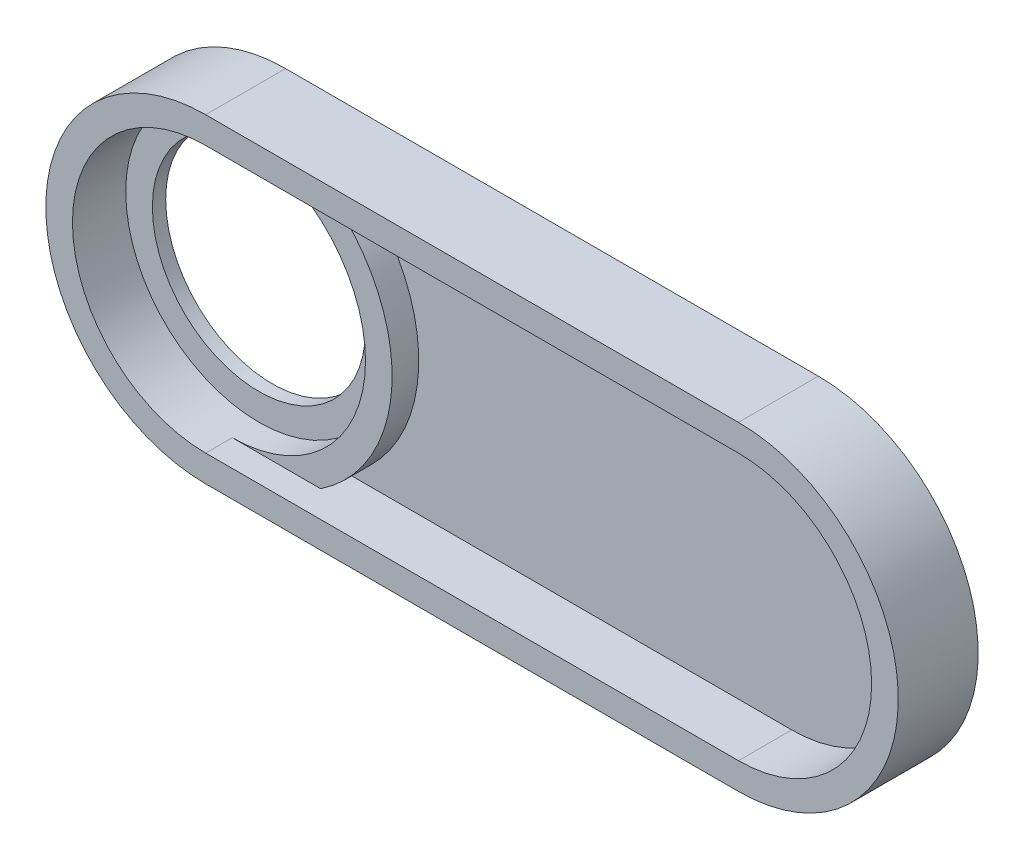
ISO-10303-21;
HEADER;
FILE_DESCRIPTION(('STEP AP214'),'2;1');
FILE_NAME('part.step','',(''),(''),'','','');
FILE_SCHEMA(('AUTOMOTIVE_DESIGN { 1 0 10303 214 1 1 1 1 }'));
ENDSEC;
DATA;
#1=APPLICATION_CONTEXT('core data for automotive mechanical design processes');
#2=APPLICATION_PROTOCOL_DEFINITION('international standard','automotive_design',2000,#1);
#3=PRODUCT_CONTEXT('',#1,'mechanical');
#4=PRODUCT('Part','Part','',(#3));
#5=PRODUCT_RELATED_PRODUCT_CATEGORY('part','',(#4));
#6=PRODUCT_DEFINITION_FORMATION('','',#4);
#7=PRODUCT_DEFINITION_CONTEXT('part definition',#1,'design');
#8=PRODUCT_DEFINITION('design','',#6,#7);
#9=PRODUCT_DEFINITION_SHAPE('','',#8);
#10=(LENGTH_UNIT() NAMED_UNIT(*) SI_UNIT(.MILLI.,.METRE.));
#11=(NAMED_UNIT(*) PLANE_ANGLE_UNIT() SI_UNIT($,.RADIAN.));
#12=(NAMED_UNIT(*) SI_UNIT($,.STERADIAN.) SOLID_ANGLE_UNIT());
#13=UNCERTAINTY_MEASURE_WITH_UNIT(LENGTH_MEASURE(1.E-05),#10,'distance_accuracy_value','');
#14=(GEOMETRIC_REPRESENTATION_CONTEXT(3) GLOBAL_UNCERTAINTY_ASSIGNED_CONTEXT((#13)) GLOBAL_UNIT_ASSIGNED_CONTEXT((#10,
#11,#12)) REPRESENTATION_CONTEXT('',''));
#15=CARTESIAN_POINT('',(0.,0.,0.));
#16=DIRECTION('',(0.,0.,1.));
#17=DIRECTION('',(1.,0.,0.));
#18=AXIS2_PLACEMENT_3D('',#15,#16,#17);
#19=CARTESIAN_POINT('',(0.,0.,10.));
#20=DIRECTION('',(0.,0.,-1.));
#21=DIRECTION('',(-1.,0.,0.));
#22=AXIS2_PLACEMENT_3D('',#19,#20,#21);
#23=CYLINDRICAL_SURFACE('',#22,60.);
#24=DIRECTION('',(0.,0.,-1.));
#25=VECTOR('',#24,1.);
#26=CARTESIAN_POINT('',(0.,-60.,10.));
#27=LINE('',#26,#25);
#28=CARTESIAN_POINT('',(0.,-60.,30.));
#29=VERTEX_POINT('',#28);
#30=CARTESIAN_POINT('',(0.,-60.,0.));
#31=VERTEX_POINT('',#30);
#32=EDGE_CURVE('E176',#29,#31,#27,.T.);
#33=ORIENTED_EDGE('',*,*,#32,.F.);
#34=CARTESIAN_POINT('',(0.,0.,30.));
#35=DIRECTION('',(0.,0.,1.));
#36=DIRECTION('',(1.,0.,0.));
#37=AXIS2_PLACEMENT_3D('',#34,#35,#36);
#38=CIRCLE('',#37,60.);
#39=CARTESIAN_POINT('',(0.,60.,30.));
#40=VERTEX_POINT('',#39);
#41=EDGE_CURVE('E130',#40,#29,#38,.T.);
#42=ORIENTED_EDGE('',*,*,#41,.F.);
#43=DIRECTION('',(0.,0.,-1.));
#44=VECTOR('',#43,1.);
#45=CARTESIAN_POINT('',(0.,60.,10.));
#46=LINE('',#45,#44);
#47=CARTESIAN_POINT('',(0.,60.,0.));
#48=VERTEX_POINT('',#47);
#49=EDGE_CURVE('E195',#40,#48,#46,.T.);
#50=ORIENTED_EDGE('',*,*,#49,.T.);
#51=CARTESIAN_POINT('',(0.,0.,0.));
#52=DIRECTION('',(0.,0.,1.));
#53=DIRECTION('',(1.,0.,0.));
#54=AXIS2_PLACEMENT_3D('',#51,#52,#53);
#55=CIRCLE('',#54,60.);
#56=EDGE_CURVE('E186',#48,#31,#55,.T.);
#57=ORIENTED_EDGE('',*,*,#56,.T.);
#58=EDGE_LOOP('',(#33,#42,#50,#57));
#59=FACE_BOUND('',#58,.T.);
#60=ADVANCED_FACE('F35',(#59),#23,.T.);
#61=CARTESIAN_POINT('',(0.,0.,10.));
#62=DIRECTION('',(0.,0.,1.));
#63=DIRECTION('',(1.,0.,0.));
#64=AXIS2_PLACEMENT_3D('',#61,#62,#63);
#65=PLANE('',#64);
#66=CARTESIAN_POINT('',(0.,0.,10.));
#67=DIRECTION('',(0.,0.,1.));
#68=DIRECTION('',(1.,0.,0.));
#69=AXIS2_PLACEMENT_3D('',#66,#67,#68);
#70=CIRCLE('',#69,40.);
#71=CARTESIAN_POINT('',(40.,0.,10.));
#72=VERTEX_POINT('',#71);
#73=EDGE_CURVE('E183',#72,#72,#70,.T.);
#74=ORIENTED_EDGE('',*,*,#73,.F.);
#75=EDGE_LOOP('',(#74));
#76=FACE_BOUND('',#75,.T.);
#77=CARTESIAN_POINT('',(0.,0.,10.));
#78=DIRECTION('',(0.,0.,1.));
#79=DIRECTION('',(1.,0.,0.));
#80=AXIS2_PLACEMENT_3D('',#77,#78,#79);
#81=CIRCLE('',#80,50.);
#82=CARTESIAN_POINT('',(50.,0.,10.));
#83=VERTEX_POINT('',#82);
#84=EDGE_CURVE('E165',#83,#83,#81,.T.);
#85=ORIENTED_EDGE('',*,*,#84,.T.);
#86=EDGE_LOOP('',(#85));
#87=FACE_BOUND('',#86,.T.);
#88=ADVANCED_FACE('F229',(#76,#87),#65,.T.);
#89=CARTESIAN_POINT('',(0.,0.,10.));
#90=DIRECTION('',(0.,0.,-1.));
#91=DIRECTION('',(-1.,0.,0.));
#92=AXIS2_PLACEMENT_3D('',#89,#90,#91);
#93=CYLINDRICAL_SURFACE('',#92,40.);
#94=ORIENTED_EDGE('',*,*,#73,.T.);
#95=EDGE_LOOP('',(#94));
#96=FACE_BOUND('',#95,.T.);
#97=CARTESIAN_POINT('',(0.,0.,5.));
#98=DIRECTION('',(0.,0.,-1.));
#99=DIRECTION('',(-1.,0.,0.));
#100=AXIS2_PLACEMENT_3D('',#97,#98,#99);
#101=CIRCLE('',#100,40.);
#102=CARTESIAN_POINT('',(-40.,0.,5.));
#103=VERTEX_POINT('',#102);
#104=EDGE_CURVE('E180',#103,#103,#101,.T.);
#105=ORIENTED_EDGE('',*,*,#104,.T.);
#106=EDGE_LOOP('',(#105));
#107=FACE_BOUND('',#106,.T.);
#108=ADVANCED_FACE('F236',(#96,#107),#93,.F.);
#109=DIRECTION('',(1.,0.,0.));
#110=VECTOR('',#109,1.);
#111=CARTESIAN_POINT('',(0.,-50.,10.));
#112=LINE('',#111,#110);
#113=CARTESIAN_POINT('',(33.166247903554,-50.,10.));
#114=VERTEX_POINT('',#113);
#115=CARTESIAN_POINT('',(200.,-50.,10.));
#116=VERTEX_POINT('',#115);
#117=EDGE_CURVE('E50',#114,#116,#112,.T.);
#118=ORIENTED_EDGE('',*,*,#117,.T.);
#119=CARTESIAN_POINT('',(200.,0.,10.));
#120=DIRECTION('',(0.,0.,1.));
#121=DIRECTION('',(1.,0.,0.));
#122=AXIS2_PLACEMENT_3D('',#119,#120,#121);
#123=CIRCLE('',#122,50.);
#124=CARTESIAN_POINT('',(200.,50.,10.));
#125=VERTEX_POINT('',#124);
#126=EDGE_CURVE('E55',#116,#125,#123,.T.);
#127=ORIENTED_EDGE('',*,*,#126,.T.);
#128=DIRECTION('',(-1.,0.,0.));
#129=VECTOR('',#128,1.);
#130=CARTESIAN_POINT('',(200.,50.,10.));
#131=LINE('',#130,#129);
#132=CARTESIAN_POINT('',(33.166247903554,50.,10.));
#133=VERTEX_POINT('',#132);
#134=EDGE_CURVE('E124',#125,#133,#131,.T.);
#135=ORIENTED_EDGE('',*,*,#134,.T.);
#136=CARTESIAN_POINT('',(0.,0.,10.));
#137=DIRECTION('',(0.,0.,1.));
#138=DIRECTION('',(1.,0.,0.));
#139=AXIS2_PLACEMENT_3D('',#136,#137,#138);
#140=CIRCLE('',#139,60.);
#141=EDGE_CURVE('E173',#114,#133,#140,.T.);
#142=ORIENTED_EDGE('',*,*,#141,.F.);
#143=EDGE_LOOP('',(#118,#127,#135,#142));
#144=FACE_BOUND('',#143,.T.);
#145=ADVANCED_FACE('F216',(#144),#65,.T.);
#146=CARTESIAN_POINT('',(0.,0.,0.));
#147=DIRECTION('',(0.,0.,1.));
#148=DIRECTION('',(1.,0.,0.));
#149=AXIS2_PLACEMENT_3D('',#146,#147,#148);
#150=PLANE('',#149);
#151=CARTESIAN_POINT('',(0.,0.,0.));
#152=DIRECTION('',(0.,0.,-1.));
#153=DIRECTION('',(-1.,0.,0.));
#154=AXIS2_PLACEMENT_3D('',#151,#152,#153);
#155=CIRCLE('',#154,52.5);
#156=CARTESIAN_POINT('',(-52.5,0.,0.));
#157=VERTEX_POINT('',#156);
#158=EDGE_CURVE('E170',#157,#157,#155,.T.);
#159=ORIENTED_EDGE('',*,*,#158,.F.);
#160=EDGE_LOOP('',(#159));
#161=FACE_BOUND('',#160,.T.);
#162=ORIENTED_EDGE('',*,*,#56,.F.);
#163=DIRECTION('',(-1.,0.,0.));
#164=VECTOR('',#163,1.);
#165=CARTESIAN_POINT('',(0.,60.,0.));
#166=LINE('',#165,#164);
#167=CARTESIAN_POINT('',(200.,60.,0.));
#168=VERTEX_POINT('',#167);
#169=EDGE_CURVE('E193',#168,#48,#166,.T.);
#170=ORIENTED_EDGE('',*,*,#169,.F.);
#171=CARTESIAN_POINT('',(200.,0.,0.));
#172=DIRECTION('',(0.,0.,1.));
#173=DIRECTION('',(1.,0.,0.));
#174=AXIS2_PLACEMENT_3D('',#171,#172,#173);
#175=CIRCLE('',#174,60.);
#176=CARTESIAN_POINT('',(200.,-60.,0.));
#177=VERTEX_POINT('',#176);
#178=EDGE_CURVE('E191',#177,#168,#175,.T.);
#179=ORIENTED_EDGE('',*,*,#178,.F.);
#180=DIRECTION('',(1.,0.,0.));
#181=VECTOR('',#180,1.);
#182=CARTESIAN_POINT('',(0.,-60.,0.));
#183=LINE('',#182,#181);
#184=EDGE_CURVE('E189',#31,#177,#183,.T.);
#185=ORIENTED_EDGE('',*,*,#184,.F.);
#186=EDGE_LOOP('',(#162,#170,#179,#185));
#187=FACE_BOUND('',#186,.T.);
#188=ADVANCED_FACE('F241',(#161,#187),#150,.F.);
#189=CARTESIAN_POINT('',(0.,0.,20.));
#190=DIRECTION('',(0.,0.,1.));
#191=DIRECTION('',(1.,0.,0.));
#192=AXIS2_PLACEMENT_3D('',#189,#190,#191);
#193=CIRCLE('',#192,60.);
#194=CARTESIAN_POINT('',(33.166247903554,-50.,20.));
#195=VERTEX_POINT('',#194);
#196=CARTESIAN_POINT('',(33.166247903554,50.,20.));
#197=VERTEX_POINT('',#196);
#198=EDGE_CURVE('E168',#195,#197,#193,.T.);
#199=ORIENTED_EDGE('',*,*,#198,.F.);
#200=DIRECTION('',(0.,0.,-1.));
#201=VECTOR('',#200,1.);
#202=CARTESIAN_POINT('',(33.166247903554,-50.,10.));
#203=LINE('',#202,#201);
#204=EDGE_CURVE('E163',#195,#114,#203,.T.);
#205=ORIENTED_EDGE('',*,*,#204,.T.);
#206=ORIENTED_EDGE('',*,*,#141,.T.);
#207=DIRECTION('',(0.,0.,-1.));
#208=VECTOR('',#207,1.);
#209=CARTESIAN_POINT('',(33.166247903554,50.,10.));
#210=LINE('',#209,#208);
#211=EDGE_CURVE('E160',#133,#197,#210,.F.);
#212=ORIENTED_EDGE('',*,*,#211,.T.);
#213=EDGE_LOOP('',(#199,#205,#206,#212));
#214=FACE_BOUND('',#213,.T.);
#215=ADVANCED_FACE('F37',(#214),#23,.T.);
#216=CARTESIAN_POINT('',(0.,-60.,10.));
#217=DIRECTION('',(0.,1.,0.));
#218=DIRECTION('',(0.,0.,1.));
#219=AXIS2_PLACEMENT_3D('',#216,#217,#218);
#220=PLANE('',#219);
#221=ORIENTED_EDGE('',*,*,#184,.T.);
#222=DIRECTION('',(0.,0.,-1.));
#223=VECTOR('',#222,1.);
#224=CARTESIAN_POINT('',(200.,-60.,10.));
#225=LINE('',#224,#223);
#226=CARTESIAN_POINT('',(200.,-60.,30.));
#227=VERTEX_POINT('',#226);
#228=EDGE_CURVE('E201',#227,#177,#225,.T.);
#229=ORIENTED_EDGE('',*,*,#228,.F.);
#230=DIRECTION('',(1.,0.,0.));
#231=VECTOR('',#230,1.);
#232=CARTESIAN_POINT('',(0.,-60.,30.));
#233=LINE('',#232,#231);
#234=EDGE_CURVE('E151',#29,#227,#233,.T.);
#235=ORIENTED_EDGE('',*,*,#234,.F.);
#236=ORIENTED_EDGE('',*,*,#32,.T.);
#237=EDGE_LOOP('',(#221,#229,#235,#236));
#238=FACE_BOUND('',#237,.T.);
#239=ADVANCED_FACE('F240',(#238),#220,.F.);
#240=CARTESIAN_POINT('',(200.,0.,10.));
#241=DIRECTION('',(0.,0.,-1.));
#242=DIRECTION('',(-1.,0.,0.));
#243=AXIS2_PLACEMENT_3D('',#240,#241,#242);
#244=CYLINDRICAL_SURFACE('',#243,60.);
#245=ORIENTED_EDGE('',*,*,#178,.T.);
#246=DIRECTION('',(0.,0.,-1.));
#247=VECTOR('',#246,1.);
#248=CARTESIAN_POINT('',(200.,60.,10.));
#249=LINE('',#248,#247);
#250=CARTESIAN_POINT('',(200.,60.,30.));
#251=VERTEX_POINT('',#250);
#252=EDGE_CURVE('E198',#251,#168,#249,.T.);
#253=ORIENTED_EDGE('',*,*,#252,.F.);
#254=CARTESIAN_POINT('',(200.,0.,30.));
#255=DIRECTION('',(0.,0.,1.));
#256=DIRECTION('',(1.,0.,0.));
#257=AXIS2_PLACEMENT_3D('',#254,#255,#256);
#258=CIRCLE('',#257,60.);
#259=EDGE_CURVE('E154',#227,#251,#258,.T.);
#260=ORIENTED_EDGE('',*,*,#259,.F.);
#261=ORIENTED_EDGE('',*,*,#228,.T.);
#262=EDGE_LOOP('',(#245,#253,#260,#261));
#263=FACE_BOUND('',#262,.T.);
#264=ADVANCED_FACE('F246',(#263),#244,.T.);
#265=CARTESIAN_POINT('',(0.,60.,10.));
#266=DIRECTION('',(0.,-1.,0.));
#267=DIRECTION('',(0.,0.,-1.));
#268=AXIS2_PLACEMENT_3D('',#265,#266,#267);
#269=PLANE('',#268);
#270=ORIENTED_EDGE('',*,*,#169,.T.);
#271=ORIENTED_EDGE('',*,*,#49,.F.);
#272=DIRECTION('',(-1.,0.,0.));
#273=VECTOR('',#272,1.);
#274=CARTESIAN_POINT('',(200.,60.,30.));
#275=LINE('',#274,#273);
#276=EDGE_CURVE('E157',#251,#40,#275,.T.);
#277=ORIENTED_EDGE('',*,*,#276,.F.);
#278=ORIENTED_EDGE('',*,*,#252,.T.);
#279=EDGE_LOOP('',(#270,#271,#277,#278));
#280=FACE_BOUND('',#279,.T.);
#281=ADVANCED_FACE('F258',(#280),#269,.F.);
#282=CARTESIAN_POINT('',(0.,0.,5.));
#283=DIRECTION('',(0.,0.,-1.));
#284=DIRECTION('',(-1.,0.,0.));
#285=AXIS2_PLACEMENT_3D('',#282,#283,#284);
#286=CYLINDRICAL_SURFACE('',#285,52.5);
#287=CARTESIAN_POINT('',(0.,0.,5.));
#288=DIRECTION('',(0.,0.,-1.));
#289=DIRECTION('',(-1.,0.,0.));
#290=AXIS2_PLACEMENT_3D('',#287,#288,#289);
#291=CIRCLE('',#290,52.5);
#292=CARTESIAN_POINT('',(-52.5,0.,5.));
#293=VERTEX_POINT('',#292);
#294=EDGE_CURVE('E177',#293,#293,#291,.T.);
#295=ORIENTED_EDGE('',*,*,#294,.F.);
#296=EDGE_LOOP('',(#295));
#297=FACE_BOUND('',#296,.T.);
#298=ORIENTED_EDGE('',*,*,#158,.T.);
#299=EDGE_LOOP('',(#298));
#300=FACE_BOUND('',#299,.T.);
#301=ADVANCED_FACE('F261',(#297,#300),#286,.F.);
#302=CARTESIAN_POINT('',(0.,0.,5.));
#303=DIRECTION('',(0.,0.,-1.));
#304=DIRECTION('',(-1.,0.,0.));
#305=AXIS2_PLACEMENT_3D('',#302,#303,#304);
#306=PLANE('',#305);
#307=ORIENTED_EDGE('',*,*,#104,.F.);
#308=EDGE_LOOP('',(#307));
#309=FACE_BOUND('',#308,.T.);
#310=ORIENTED_EDGE('',*,*,#294,.T.);
#311=EDGE_LOOP('',(#310));
#312=FACE_BOUND('',#311,.T.);
#313=ADVANCED_FACE('F285',(#309,#312),#306,.T.);
#314=CARTESIAN_POINT('',(0.,0.,20.));
#315=DIRECTION('',(0.,0.,-1.));
#316=DIRECTION('',(-1.,0.,0.));
#317=AXIS2_PLACEMENT_3D('',#314,#315,#316);
#318=CYLINDRICAL_SURFACE('',#317,50.);
#319=ORIENTED_EDGE('',*,*,#84,.F.);
#320=EDGE_LOOP('',(#319));
#321=FACE_BOUND('',#320,.T.);
#322=DIRECTION('',(0.,0.,-1.));
#323=VECTOR('',#322,1.);
#324=CARTESIAN_POINT('',(0.,-50.,30.));
#325=LINE('',#324,#323);
#326=CARTESIAN_POINT('',(0.,-50.,30.));
#327=VERTEX_POINT('',#326);
#328=CARTESIAN_POINT('',(0.,-50.,20.));
#329=VERTEX_POINT('',#328);
#330=EDGE_CURVE('E117',#327,#329,#325,.T.);
#331=ORIENTED_EDGE('',*,*,#330,.T.);
#332=CARTESIAN_POINT('',(0.,0.,20.));
#333=DIRECTION('',(0.,0.,1.));
#334=DIRECTION('',(1.,0.,0.));
#335=AXIS2_PLACEMENT_3D('',#332,#333,#334);
#336=CIRCLE('',#335,50.);
#337=CARTESIAN_POINT('',(0.,50.,20.));
#338=VERTEX_POINT('',#337);
#339=EDGE_CURVE('E166',#329,#338,#336,.T.);
#340=ORIENTED_EDGE('',*,*,#339,.T.);
#341=DIRECTION('',(0.,0.,-1.));
#342=VECTOR('',#341,1.);
#343=CARTESIAN_POINT('',(0.,50.,30.));
#344=LINE('',#343,#342);
#345=CARTESIAN_POINT('',(0.,50.,30.));
#346=VERTEX_POINT('',#345);
#347=EDGE_CURVE('E119',#346,#338,#344,.T.);
#348=ORIENTED_EDGE('',*,*,#347,.F.);
#349=CARTESIAN_POINT('',(0.,0.,30.));
#350=DIRECTION('',(0.,0.,1.));
#351=DIRECTION('',(1.,0.,0.));
#352=AXIS2_PLACEMENT_3D('',#349,#350,#351);
#353=CIRCLE('',#352,50.);
#354=EDGE_CURVE('E113',#346,#327,#353,.T.);
#355=ORIENTED_EDGE('',*,*,#354,.T.);
#356=EDGE_LOOP('',(#331,#340,#348,#355));
#357=FACE_BOUND('',#356,.T.);
#358=ADVANCED_FACE('F115',(#321,#357),#318,.F.);
#359=CARTESIAN_POINT('',(0.,0.,20.));
#360=DIRECTION('',(0.,0.,1.));
#361=DIRECTION('',(1.,0.,0.));
#362=AXIS2_PLACEMENT_3D('',#359,#360,#361);
#363=PLANE('',#362);
#364=DIRECTION('',(-1.,0.,0.));
#365=VECTOR('',#364,1.);
#366=CARTESIAN_POINT('',(0.,-50.,20.));
#367=LINE('',#366,#365);
#368=EDGE_CURVE('E11',#195,#329,#367,.T.);
#369=ORIENTED_EDGE('',*,*,#368,.F.);
#370=ORIENTED_EDGE('',*,*,#198,.T.);
#371=DIRECTION('',(1.,0.,0.));
#372=VECTOR('',#371,1.);
#373=CARTESIAN_POINT('',(0.,50.,20.));
#374=LINE('',#373,#372);
#375=EDGE_CURVE('E43',#338,#197,#374,.T.);
#376=ORIENTED_EDGE('',*,*,#375,.F.);
#377=ORIENTED_EDGE('',*,*,#339,.F.);
#378=EDGE_LOOP('',(#369,#370,#376,#377));
#379=FACE_BOUND('',#378,.T.);
#380=ADVANCED_FACE('F213',(#379),#363,.T.);
#381=CARTESIAN_POINT('',(0.,-50.,30.));
#382=DIRECTION('',(0.,1.,0.));
#383=DIRECTION('',(0.,0.,1.));
#384=AXIS2_PLACEMENT_3D('',#381,#382,#383);
#385=PLANE('',#384);
#386=ORIENTED_EDGE('',*,*,#204,.F.);
#387=ORIENTED_EDGE('',*,*,#368,.T.);
#388=ORIENTED_EDGE('',*,*,#330,.F.);
#389=DIRECTION('',(1.,0.,0.));
#390=VECTOR('',#389,1.);
#391=CARTESIAN_POINT('',(0.,-50.,30.));
#392=LINE('',#391,#390);
#393=CARTESIAN_POINT('',(200.,-50.,30.));
#394=VERTEX_POINT('',#393);
#395=EDGE_CURVE('E123',#327,#394,#392,.T.);
#396=ORIENTED_EDGE('',*,*,#395,.T.);
#397=DIRECTION('',(0.,0.,-1.));
#398=VECTOR('',#397,1.);
#399=CARTESIAN_POINT('',(200.,-50.,30.));
#400=LINE('',#399,#398);
#401=EDGE_CURVE('E131',#394,#116,#400,.T.);
#402=ORIENTED_EDGE('',*,*,#401,.T.);
#403=ORIENTED_EDGE('',*,*,#117,.F.);
#404=EDGE_LOOP('',(#386,#387,#388,#396,#402,#403));
#405=FACE_BOUND('',#404,.T.);
#406=ADVANCED_FACE('F128',(#405),#385,.T.);
#407=CARTESIAN_POINT('',(200.,50.,30.));
#408=DIRECTION('',(0.,-1.,0.));
#409=DIRECTION('',(0.,0.,-1.));
#410=AXIS2_PLACEMENT_3D('',#407,#408,#409);
#411=PLANE('',#410);
#412=ORIENTED_EDGE('',*,*,#211,.F.);
#413=ORIENTED_EDGE('',*,*,#134,.F.);
#414=DIRECTION('',(0.,0.,-1.));
#415=VECTOR('',#414,1.);
#416=CARTESIAN_POINT('',(200.,50.,30.));
#417=LINE('',#416,#415);
#418=CARTESIAN_POINT('',(200.,50.,30.));
#419=VERTEX_POINT('',#418);
#420=EDGE_CURVE('E146',#419,#125,#417,.T.);
#421=ORIENTED_EDGE('',*,*,#420,.F.);
#422=DIRECTION('',(-1.,0.,0.));
#423=VECTOR('',#422,1.);
#424=CARTESIAN_POINT('',(200.,50.,30.));
#425=LINE('',#424,#423);
#426=EDGE_CURVE('E138',#419,#346,#425,.T.);
#427=ORIENTED_EDGE('',*,*,#426,.T.);
#428=ORIENTED_EDGE('',*,*,#347,.T.);
#429=ORIENTED_EDGE('',*,*,#375,.T.);
#430=EDGE_LOOP('',(#412,#413,#421,#427,#428,#429));
#431=FACE_BOUND('',#430,.T.);
#432=ADVANCED_FACE('F210',(#431),#411,.T.);
#433=CARTESIAN_POINT('',(0.,0.,30.));
#434=DIRECTION('',(0.,0.,1.));
#435=DIRECTION('',(1.,0.,0.));
#436=AXIS2_PLACEMENT_3D('',#433,#434,#435);
#437=PLANE('',#436);
#438=ORIENTED_EDGE('',*,*,#41,.T.);
#439=ORIENTED_EDGE('',*,*,#234,.T.);
#440=ORIENTED_EDGE('',*,*,#259,.T.);
#441=ORIENTED_EDGE('',*,*,#276,.T.);
#442=EDGE_LOOP('',(#438,#439,#440,#441));
#443=FACE_BOUND('',#442,.T.);
#444=ORIENTED_EDGE('',*,*,#395,.F.);
#445=ORIENTED_EDGE('',*,*,#354,.F.);
#446=ORIENTED_EDGE('',*,*,#426,.F.);
#447=CARTESIAN_POINT('',(200.,0.,30.));
#448=DIRECTION('',(0.,0.,1.));
#449=DIRECTION('',(1.,0.,0.));
#450=AXIS2_PLACEMENT_3D('',#447,#448,#449);
#451=CIRCLE('',#450,50.);
#452=EDGE_CURVE('E136',#394,#419,#451,.T.);
#453=ORIENTED_EDGE('',*,*,#452,.F.);
#454=EDGE_LOOP('',(#444,#445,#446,#453));
#455=FACE_BOUND('',#454,.T.);
#456=ADVANCED_FACE('F134',(#443,#455),#437,.T.);
#457=CARTESIAN_POINT('',(200.,0.,30.));
#458=DIRECTION('',(0.,0.,-1.));
#459=DIRECTION('',(-1.,0.,0.));
#460=AXIS2_PLACEMENT_3D('',#457,#458,#459);
#461=CYLINDRICAL_SURFACE('',#460,50.);
#462=ORIENTED_EDGE('',*,*,#126,.F.);
#463=ORIENTED_EDGE('',*,*,#401,.F.);
#464=ORIENTED_EDGE('',*,*,#452,.T.);
#465=ORIENTED_EDGE('',*,*,#420,.T.);
#466=EDGE_LOOP('',(#462,#463,#464,#465));
#467=FACE_BOUND('',#466,.T.);
#468=ADVANCED_FACE('F218',(#467),#461,.F.);
#469=CLOSED_SHELL('',(#60,#88,#108,#145,#188,#215,#239,#264,#281,#301,#313,#358,#380,#406,#432,
#456,#468));
#470=MANIFOLD_SOLID_BREP('B2',#469);
#471=ADVANCED_BREP_SHAPE_REPRESENTATION('',(#18,#470),#14);
#472=SHAPE_DEFINITION_REPRESENTATION(#9,#471);
ENDSEC;
END-ISO-10303-21;
